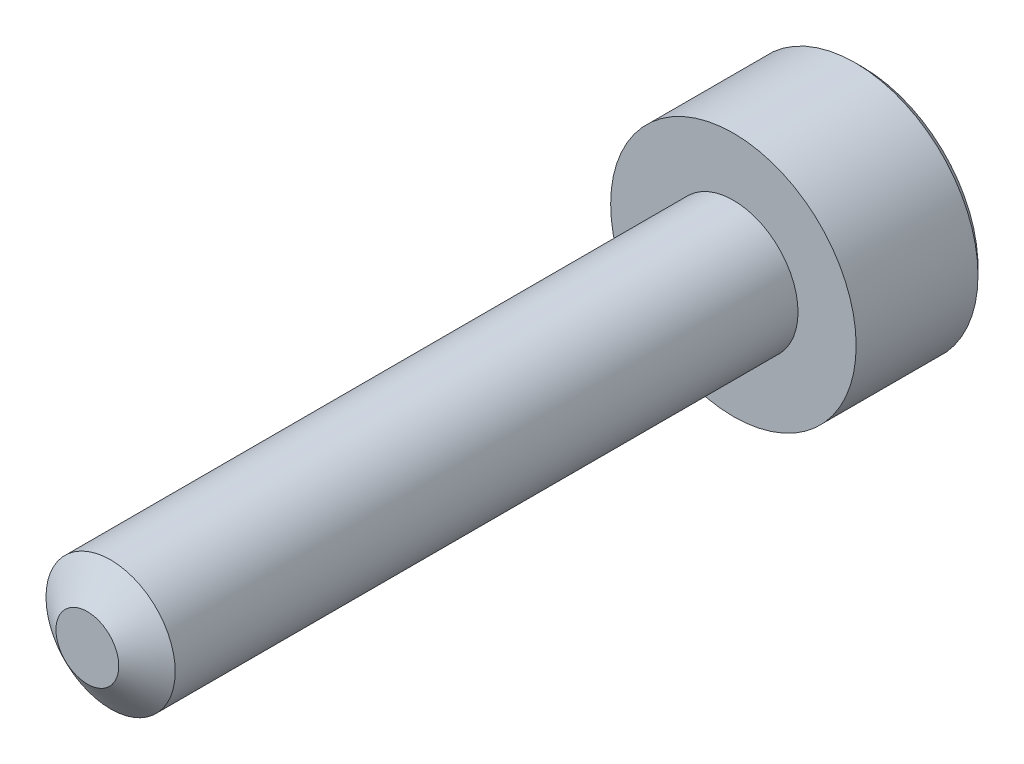
ISO-10303-21;
HEADER;
FILE_DESCRIPTION(('STEP AP214'),'2;1');
FILE_NAME('part.step','',(''),(''),'','','');
FILE_SCHEMA(('AUTOMOTIVE_DESIGN { 1 0 10303 214 1 1 1 1 }'));
ENDSEC;
DATA;
#1=APPLICATION_CONTEXT('core data for automotive mechanical design processes');
#2=APPLICATION_PROTOCOL_DEFINITION('international standard','automotive_design',2000,#1);
#3=PRODUCT_CONTEXT('',#1,'mechanical');
#4=PRODUCT('Part','Part','',(#3));
#5=PRODUCT_RELATED_PRODUCT_CATEGORY('part','',(#4));
#6=PRODUCT_DEFINITION_FORMATION('','',#4);
#7=PRODUCT_DEFINITION_CONTEXT('part definition',#1,'design');
#8=PRODUCT_DEFINITION('design','',#6,#7);
#9=PRODUCT_DEFINITION_SHAPE('','',#8);
#10=(LENGTH_UNIT() NAMED_UNIT(*) SI_UNIT(.MILLI.,.METRE.));
#11=(NAMED_UNIT(*) PLANE_ANGLE_UNIT() SI_UNIT($,.RADIAN.));
#12=(NAMED_UNIT(*) SI_UNIT($,.STERADIAN.) SOLID_ANGLE_UNIT());
#13=UNCERTAINTY_MEASURE_WITH_UNIT(LENGTH_MEASURE(1.E-05),#10,'distance_accuracy_value','');
#14=(GEOMETRIC_REPRESENTATION_CONTEXT(3) GLOBAL_UNCERTAINTY_ASSIGNED_CONTEXT((#13)) GLOBAL_UNIT_ASSIGNED_CONTEXT((#10,
#11,#12)) REPRESENTATION_CONTEXT('',''));
#15=CARTESIAN_POINT('',(0.,0.,0.));
#16=DIRECTION('',(0.,0.,1.));
#17=DIRECTION('',(1.,0.,0.));
#18=AXIS2_PLACEMENT_3D('',#15,#16,#17);
#19=CARTESIAN_POINT('',(0.75,1.29903810567666,-10.875));
#20=DIRECTION('',(0.,0.,-1.));
#21=DIRECTION('',(-1.,0.,0.));
#22=AXIS2_PLACEMENT_3D('',#19,#20,#21);
#23=PLANE('',#22);
#24=DIRECTION('',(0.866025403784439,-0.5,0.));
#25=VECTOR('',#24,1.);
#26=CARTESIAN_POINT('',(0.,-0.866025403784439,-10.875));
#27=LINE('',#26,#25);
#28=CARTESIAN_POINT('',(0.,-0.866025403784438,-10.875));
#29=VERTEX_POINT('',#28);
#30=CARTESIAN_POINT('',(-0.75,-0.43301270189222,-10.875));
#31=VERTEX_POINT('',#30);
#32=EDGE_CURVE('E83',#29,#31,#27,.F.);
#33=ORIENTED_EDGE('',*,*,#32,.T.);
#34=DIRECTION('',(0.,-1.,0.));
#35=VECTOR('',#34,1.);
#36=CARTESIAN_POINT('',(-0.75,-0.433012701892219,-10.875));
#37=LINE('',#36,#35);
#38=CARTESIAN_POINT('',(-0.75,0.43301270189222,-10.875));
#39=VERTEX_POINT('',#38);
#40=EDGE_CURVE('E85',#31,#39,#37,.F.);
#41=ORIENTED_EDGE('',*,*,#40,.T.);
#42=DIRECTION('',(-0.866025403784439,-0.5,0.));
#43=VECTOR('',#42,1.);
#44=CARTESIAN_POINT('',(-0.75,0.43301270189222,-10.875));
#45=LINE('',#44,#43);
#46=CARTESIAN_POINT('',(0.,0.866025403784439,-10.875));
#47=VERTEX_POINT('',#46);
#48=EDGE_CURVE('E86',#39,#47,#45,.F.);
#49=ORIENTED_EDGE('',*,*,#48,.T.);
#50=DIRECTION('',(-0.866025403784439,0.5,0.));
#51=VECTOR('',#50,1.);
#52=CARTESIAN_POINT('',(0.,0.866025403784439,-10.875));
#53=LINE('',#52,#51);
#54=CARTESIAN_POINT('',(0.75,0.43301270189222,-10.875));
#55=VERTEX_POINT('',#54);
#56=EDGE_CURVE('E72',#47,#55,#53,.F.);
#57=ORIENTED_EDGE('',*,*,#56,.T.);
#58=DIRECTION('',(0.,1.,0.));
#59=VECTOR('',#58,1.);
#60=CARTESIAN_POINT('',(0.75,0.433012701892219,-10.875));
#61=LINE('',#60,#59);
#62=CARTESIAN_POINT('',(0.75,-0.433012701892219,-10.875));
#63=VERTEX_POINT('',#62);
#64=EDGE_CURVE('E111',#55,#63,#61,.F.);
#65=ORIENTED_EDGE('',*,*,#64,.T.);
#66=DIRECTION('',(0.866025403784439,0.5,0.));
#67=VECTOR('',#66,1.);
#68=CARTESIAN_POINT('',(0.75,-0.433012701892219,-10.875));
#69=LINE('',#68,#67);
#70=EDGE_CURVE('E116',#63,#29,#69,.F.);
#71=ORIENTED_EDGE('',*,*,#70,.T.);
#72=EDGE_LOOP('',(#33,#41,#49,#57,#65,#71));
#73=FACE_BOUND('',#72,.T.);
#74=ADVANCED_FACE('F17',(#73),#23,.T.);
#75=CARTESIAN_POINT('',(-0.75,0.43301270189222,-10.875));
#76=DIRECTION('',(-0.5,0.866025403784439,0.));
#77=DIRECTION('',(-0.866025403784439,-0.5,0.));
#78=AXIS2_PLACEMENT_3D('',#75,#76,#77);
#79=PLANE('',#78);
#80=CARTESIAN_POINT('',(-0.750000000040529,0.43301270186855,-11.9999999999426));
#81=CARTESIAN_POINT('',(-0.724222098361885,0.447895580342032,-11.9851314747047));
#82=CARTESIAN_POINT('',(-0.698013243251965,0.463027269894967,-11.9711362751578));
#83=CARTESIAN_POINT('',(-0.644570697690296,0.493882337961228,-11.9455116575959));
#84=CARTESIAN_POINT('',(-0.617331927624619,0.509608649191022,-11.9338964924212));
#85=CARTESIAN_POINT('',(-0.562406176657021,0.541320046297593,-11.9139997801948));
#86=CARTESIAN_POINT('',(-0.534733177823342,0.557297059623507,-11.9056682343593));
#87=CARTESIAN_POINT('',(-0.478778549519084,0.589602479337379,-11.8928313651219));
#88=CARTESIAN_POINT('',(-0.450498627105905,0.605929900155289,-11.8883164648236));
#89=CARTESIAN_POINT('',(-0.401754212824382,0.634072500862216,-11.8842441635211));
#90=CARTESIAN_POINT('',(-0.381353021236444,0.645851134317301,-11.8836424251561));
#91=CARTESIAN_POINT('',(-0.340590218284616,0.669385549574463,-11.884656584782));
#92=CARTESIAN_POINT('',(-0.320228616658731,0.6811413257543,-11.8862729726425));
#93=CARTESIAN_POINT('',(-0.259434728846723,0.716240693247646,-11.8943424897742));
#94=CARTESIAN_POINT('',(-0.219305071732706,0.739409561584911,-11.9040168811747));
#95=CARTESIAN_POINT('',(-0.148902945251058,0.780056248260613,-11.9273532604901));
#96=CARTESIAN_POINT('',(-0.118299096510162,0.797725388569408,-11.9397877408232));
#97=CARTESIAN_POINT('',(-0.0582891007940733,0.83237217575016,-11.9677959637177));
#98=CARTESIAN_POINT('',(-0.028879420212564,0.849351862750675,-11.9833594872014));
#99=CARTESIAN_POINT('',(4.06728419388189E-11,0.866025403807922,-11.9999999999424));
#100=B_SPLINE_CURVE_WITH_KNOTS('',3,(#80,#81,#82,#83,#84,#85,#86,#87,#88,#89,#90,#91,#92,#93,
#94,#95,#96,#97,#98,#99),.UNSPECIFIED.,.F.,.F.,(4,2,2,2,2,2,2,2,2,4),(0.,0.0998872099789562,
0.200356156186847,0.299229995240019,0.39785499294776,0.46844734555236,0.539055290873642,
0.680311200793199,0.792547810185166,0.90442365474513),.UNSPECIFIED.);
#101=CARTESIAN_POINT('',(-0.750000000035288,0.433012701912593,-11.9999999999597));
#102=VERTEX_POINT('',#101);
#103=CARTESIAN_POINT('',(-5.02313178448405E-11,0.866025403836932,-11.9999999999715));
#104=VERTEX_POINT('',#103);
#105=EDGE_CURVE('E20',#102,#104,#100,.T.);
#106=ORIENTED_EDGE('',*,*,#105,.T.);
#107=DIRECTION('',(0.,0.,1.));
#108=VECTOR('',#107,1.);
#109=CARTESIAN_POINT('',(0.,0.866025403784439,-10.875));
#110=LINE('',#109,#108);
#111=EDGE_CURVE('E91',#104,#47,#110,.T.);
#112=ORIENTED_EDGE('',*,*,#111,.T.);
#113=ORIENTED_EDGE('',*,*,#48,.F.);
#114=DIRECTION('',(0.,0.,1.));
#115=VECTOR('',#114,1.);
#116=CARTESIAN_POINT('',(-0.75,0.43301270189222,-10.875));
#117=LINE('',#116,#115);
#118=EDGE_CURVE('E59',#39,#102,#117,.F.);
#119=ORIENTED_EDGE('',*,*,#118,.T.);
#120=EDGE_LOOP('',(#106,#112,#113,#119));
#121=FACE_BOUND('',#120,.T.);
#122=ADVANCED_FACE('F90',(#121),#79,.F.);
#123=CARTESIAN_POINT('',(-0.75,-0.433012701892219,-10.875));
#124=DIRECTION('',(-1.,0.,0.));
#125=DIRECTION('',(0.,-1.,0.));
#126=AXIS2_PLACEMENT_3D('',#123,#124,#125);
#127=PLANE('',#126);
#128=CARTESIAN_POINT('',(-0.749999999999766,-0.433012701939152,-11.9999999999426));
#129=CARTESIAN_POINT('',(-0.749999999999916,-0.403246944992447,-11.9851314747047));
#130=CARTESIAN_POINT('',(-0.749999999999977,-0.372983565886684,-11.9711362751578));
#131=CARTESIAN_POINT('',(-0.750000000000023,-0.31127342975424,-11.9455116575959));
#132=CARTESIAN_POINT('',(-0.750000000000006,-0.279820807294623,-11.9338964924212));
#133=CARTESIAN_POINT('',(-0.749999999999994,-0.21639801308146,-11.9139997801948));
#134=CARTESIAN_POINT('',(-0.749999999999998,-0.184443986429638,-11.9056682343593));
#135=CARTESIAN_POINT('',(-0.750000000000001,-0.119833147001899,-11.8928313651219));
#136=CARTESIAN_POINT('',(-0.75,-0.0871783053660778,-11.8883164648236));
#137=CARTESIAN_POINT('',(-0.75,-0.0308931039522219,-11.8842441635211));
#138=CARTESIAN_POINT('',(-0.75,-0.00733583704205067,-11.8836424251561));
#139=CARTESIAN_POINT('',(-0.75,0.0397329934722727,-11.884656584782));
#140=CARTESIAN_POINT('',(-0.75,0.0632445458319463,-11.8862729726425));
#141=CARTESIAN_POINT('',(-0.75,0.133443280818641,-11.8943424897742));
#142=CARTESIAN_POINT('',(-0.75,0.179781017493171,-11.9040168811747));
#143=CARTESIAN_POINT('',(-0.75,0.261074390844573,-11.9273532604901));
#144=CARTESIAN_POINT('',(-0.75,0.296412671462162,-11.9397877408232));
#145=CARTESIAN_POINT('',(-0.75,0.365706245823664,-11.9677959637177));
#146=CARTESIAN_POINT('',(-0.75,0.399665619824693,-11.9833594872014));
#147=CARTESIAN_POINT('',(-0.75,0.433012701939185,-11.9999999999424));
#148=B_SPLINE_CURVE_WITH_KNOTS('',3,(#128,#129,#130,#131,#132,#133,#134,#135,#136,#137,#138,
#139,#140,#141,#142,#143,#144,#145,#146,#147),.UNSPECIFIED.,.F.,.F.,(4,2,2,2,2,2,2,2,2,4),(0.,
0.0998872099789572,0.200356156186849,0.299229995240022,0.397854992947765,0.468447345552365,
0.539055290873648,0.680311200793207,0.79254781018517,0.904423654745129),.UNSPECIFIED.);
#149=CARTESIAN_POINT('',(-0.750000000035288,-0.433012701912593,-11.9999999999597));
#150=VERTEX_POINT('',#149);
#151=EDGE_CURVE('E95',#150,#102,#148,.T.);
#152=ORIENTED_EDGE('',*,*,#151,.T.);
#153=ORIENTED_EDGE('',*,*,#118,.F.);
#154=ORIENTED_EDGE('',*,*,#40,.F.);
#155=DIRECTION('',(0.,0.,1.));
#156=VECTOR('',#155,1.);
#157=CARTESIAN_POINT('',(-0.75,-0.43301270189222,-10.875));
#158=LINE('',#157,#156);
#159=EDGE_CURVE('E97',#31,#150,#158,.F.);
#160=ORIENTED_EDGE('',*,*,#159,.T.);
#161=EDGE_LOOP('',(#152,#153,#154,#160));
#162=FACE_BOUND('',#161,.T.);
#163=ADVANCED_FACE('F93',(#162),#127,.F.);
#164=CARTESIAN_POINT('',(0.,-0.866025403784439,-10.875));
#165=DIRECTION('',(-0.5,-0.866025403784439,0.));
#166=DIRECTION('',(0.866025403784439,-0.5,0.));
#167=AXIS2_PLACEMENT_3D('',#164,#165,#166);
#168=PLANE('',#167);
#169=CARTESIAN_POINT('',(4.07615997293175E-11,-0.866025403807703,-11.9999999999426));
#170=CARTESIAN_POINT('',(-0.0257779016380326,-0.85114252533448,-11.9851314747047));
#171=CARTESIAN_POINT('',(-0.0519867567480134,-0.836010835781652,-11.9711362751578));
#172=CARTESIAN_POINT('',(-0.105429302309728,-0.805155767715469,-11.945511657596));
#173=CARTESIAN_POINT('',(-0.132668072375389,-0.789429456485647,-11.9338964924212));
#174=CARTESIAN_POINT('',(-0.187593823342974,-0.757718059379055,-11.9139997801948));
#175=CARTESIAN_POINT('',(-0.215266822176659,-0.741741046053148,-11.9056682343593));
#176=CARTESIAN_POINT('',(-0.271221450480919,-0.709435626339281,-11.8928313651219));
#177=CARTESIAN_POINT('',(-0.299501372894097,-0.69310820552137,-11.8883164648236));
#178=CARTESIAN_POINT('',(-0.348245787175619,-0.664965604814442,-11.8842441635211));
#179=CARTESIAN_POINT('',(-0.368646978763558,-0.653186971359357,-11.8836424251561));
#180=CARTESIAN_POINT('',(-0.409409781715386,-0.629652556102195,-11.884656584782));
#181=CARTESIAN_POINT('',(-0.429771383341271,-0.617896779922359,-11.8862729726425));
#182=CARTESIAN_POINT('',(-0.490565271153279,-0.582797412429012,-11.8943424897742));
#183=CARTESIAN_POINT('',(-0.530694928267295,-0.559628544091747,-11.9040168811747));
#184=CARTESIAN_POINT('',(-0.601097054748943,-0.518981857416046,-11.9273532604901));
#185=CARTESIAN_POINT('',(-0.63170090348984,-0.50131271710725,-11.9397877408232));
#186=CARTESIAN_POINT('',(-0.691710899205928,-0.466665929926499,-11.9677959637177));
#187=CARTESIAN_POINT('',(-0.721120579787437,-0.449686242925983,-11.9833594872014));
#188=CARTESIAN_POINT('',(-0.750000000040674,-0.433012701868737,-11.9999999999424));
#189=B_SPLINE_CURVE_WITH_KNOTS('',3,(#169,#170,#171,#172,#173,#174,#175,#176,#177,#178,#179,
#180,#181,#182,#183,#184,#185,#186,#187,#188),.UNSPECIFIED.,.F.,.F.,(4,2,2,2,2,2,2,2,2,4),(0.,
0.0998872099789563,0.200356156186849,0.29922999524002,0.397854992947762,0.468447345552361,
0.539055290873643,0.6803112007932,0.792547810185166,0.904423654745131),.UNSPECIFIED.);
#190=CARTESIAN_POINT('',(0.,-0.866025403825186,-11.9999999999597));
#191=VERTEX_POINT('',#190);
#192=EDGE_CURVE('E198',#191,#150,#189,.T.);
#193=ORIENTED_EDGE('',*,*,#192,.T.);
#194=ORIENTED_EDGE('',*,*,#159,.F.);
#195=ORIENTED_EDGE('',*,*,#32,.F.);
#196=DIRECTION('',(0.,0.,1.));
#197=VECTOR('',#196,1.);
#198=CARTESIAN_POINT('',(0.,-0.866025403784438,-10.875));
#199=LINE('',#198,#197);
#200=EDGE_CURVE('E113',#29,#191,#199,.F.);
#201=ORIENTED_EDGE('',*,*,#200,.T.);
#202=EDGE_LOOP('',(#193,#194,#195,#201));
#203=FACE_BOUND('',#202,.T.);
#204=ADVANCED_FACE('F208',(#203),#168,.F.);
#205=CARTESIAN_POINT('',(0.75,-0.433012701892219,-10.875));
#206=DIRECTION('',(0.5,-0.866025403784439,0.));
#207=DIRECTION('',(0.866025403784439,0.5,0.));
#208=AXIS2_PLACEMENT_3D('',#205,#206,#207);
#209=PLANE('',#208);
#210=CARTESIAN_POINT('',(0.750000000040528,-0.43301270186855,-11.9999999999426));
#211=CARTESIAN_POINT('',(0.724222098361884,-0.447895580342032,-11.9851314747047));
#212=CARTESIAN_POINT('',(0.698013243251965,-0.463027269894967,-11.9711362751578));
#213=CARTESIAN_POINT('',(0.644570697690296,-0.493882337961228,-11.9455116575959));
#214=CARTESIAN_POINT('',(0.617331927624618,-0.509608649191022,-11.9338964924212));
#215=CARTESIAN_POINT('',(0.562406176657021,-0.541320046297592,-11.9139997801948));
#216=CARTESIAN_POINT('',(0.534733177823341,-0.557297059623507,-11.9056682343593));
#217=CARTESIAN_POINT('',(0.478778549519083,-0.589602479337379,-11.8928313651219));
#218=CARTESIAN_POINT('',(0.450498627105903,-0.605929900155289,-11.8883164648236));
#219=CARTESIAN_POINT('',(0.40175421282438,-0.634072500862216,-11.8842441635211));
#220=CARTESIAN_POINT('',(0.381353021236442,-0.645851134317301,-11.8836424251561));
#221=CARTESIAN_POINT('',(0.340590218284614,-0.669385549574463,-11.884656584782));
#222=CARTESIAN_POINT('',(0.320228616658729,-0.6811413257543,-11.8862729726425));
#223=CARTESIAN_POINT('',(0.259434728846721,-0.716240693247646,-11.8943424897742));
#224=CARTESIAN_POINT('',(0.219305071732705,-0.739409561584911,-11.9040168811747));
#225=CARTESIAN_POINT('',(0.148902945251057,-0.780056248260612,-11.9273532604901));
#226=CARTESIAN_POINT('',(0.118299096510161,-0.797725388569407,-11.9397877408232));
#227=CARTESIAN_POINT('',(0.0582891007940729,-0.832372175750159,-11.9677959637177));
#228=CARTESIAN_POINT('',(0.0288794202125636,-0.849351862750674,-11.9833594872014));
#229=CARTESIAN_POINT('',(-4.06730801948678E-11,-0.866025403807921,-11.9999999999424));
#230=B_SPLINE_CURVE_WITH_KNOTS('',3,(#210,#211,#212,#213,#214,#215,#216,#217,#218,#219,#220,
#221,#222,#223,#224,#225,#226,#227,#228,#229),.UNSPECIFIED.,.F.,.F.,(4,2,2,2,2,2,2,2,2,4),(0.,
0.0998872099789561,0.200356156186847,0.29922999524002,0.397854992947762,0.468447345552361,
0.539055290873644,0.6803112007932,0.792547810185166,0.90442365474513),.UNSPECIFIED.);
#231=CARTESIAN_POINT('',(0.750000000035288,-0.433012701912593,-11.9999999999597));
#232=VERTEX_POINT('',#231);
#233=EDGE_CURVE('E190',#232,#191,#230,.T.);
#234=ORIENTED_EDGE('',*,*,#233,.T.);
#235=ORIENTED_EDGE('',*,*,#200,.F.);
#236=ORIENTED_EDGE('',*,*,#70,.F.);
#237=DIRECTION('',(0.,0.,-1.));
#238=VECTOR('',#237,1.);
#239=CARTESIAN_POINT('',(0.75,-0.433012701892219,-10.875));
#240=LINE('',#239,#238);
#241=EDGE_CURVE('E108',#63,#232,#240,.T.);
#242=ORIENTED_EDGE('',*,*,#241,.T.);
#243=EDGE_LOOP('',(#234,#235,#236,#242));
#244=FACE_BOUND('',#243,.T.);
#245=ADVANCED_FACE('F204',(#244),#209,.F.);
#246=CARTESIAN_POINT('',(0.75,0.433012701892219,-10.875));
#247=DIRECTION('',(1.,0.,0.));
#248=DIRECTION('',(0.,0.,-1.));
#249=AXIS2_PLACEMENT_3D('',#246,#247,#248);
#250=PLANE('',#249);
#251=CARTESIAN_POINT('',(0.749999999999766,0.433012701939153,-11.9999999999426));
#252=CARTESIAN_POINT('',(0.749999999999916,0.403246944992448,-11.9851314747047));
#253=CARTESIAN_POINT('',(0.749999999999977,0.372983565886685,-11.9711362751578));
#254=CARTESIAN_POINT('',(0.750000000000023,0.311273429754241,-11.945511657596));
#255=CARTESIAN_POINT('',(0.750000000000006,0.279820807294624,-11.9338964924212));
#256=CARTESIAN_POINT('',(0.749999999999994,0.216398013081461,-11.9139997801948));
#257=CARTESIAN_POINT('',(0.749999999999998,0.184443986429639,-11.9056682343593));
#258=CARTESIAN_POINT('',(0.750000000000002,0.1198331470019,-11.8928313651219));
#259=CARTESIAN_POINT('',(0.75,0.0871783053660792,-11.8883164648236));
#260=CARTESIAN_POINT('',(0.75,0.0308931039522236,-11.8842441635211));
#261=CARTESIAN_POINT('',(0.75,0.00733583704205245,-11.8836424251561));
#262=CARTESIAN_POINT('',(0.75,-0.0397329934722707,-11.884656584782));
#263=CARTESIAN_POINT('',(0.75,-0.0632445458319443,-11.8862729726425));
#264=CARTESIAN_POINT('',(0.75,-0.133443280818639,-11.8943424897742));
#265=CARTESIAN_POINT('',(0.75,-0.179781017493169,-11.9040168811747));
#266=CARTESIAN_POINT('',(0.75,-0.261074390844572,-11.9273532604901));
#267=CARTESIAN_POINT('',(0.75,-0.296412671462161,-11.9397877408232));
#268=CARTESIAN_POINT('',(0.75,-0.365706245823663,-11.9677959637177));
#269=CARTESIAN_POINT('',(0.75,-0.399665619824692,-11.9833594872014));
#270=CARTESIAN_POINT('',(0.75,-0.433012701939185,-11.9999999999424));
#271=B_SPLINE_CURVE_WITH_KNOTS('',3,(#251,#252,#253,#254,#255,#256,#257,#258,#259,#260,#261,
#262,#263,#264,#265,#266,#267,#268,#269,#270),.UNSPECIFIED.,.F.,.F.,(4,2,2,2,2,2,2,2,2,4),(0.,
0.0998872099789555,0.200356156186849,0.299229995240022,0.397854992947764,0.468447345552364,
0.539055290873647,0.680311200793205,0.79254781018517,0.90442365474513),.UNSPECIFIED.);
#272=CARTESIAN_POINT('',(0.750000000035288,0.433012701912593,-11.9999999999597));
#273=VERTEX_POINT('',#272);
#274=EDGE_CURVE('E160',#273,#232,#271,.T.);
#275=ORIENTED_EDGE('',*,*,#274,.T.);
#276=ORIENTED_EDGE('',*,*,#241,.F.);
#277=ORIENTED_EDGE('',*,*,#64,.F.);
#278=DIRECTION('',(0.,0.,1.));
#279=VECTOR('',#278,1.);
#280=CARTESIAN_POINT('',(0.75,0.43301270189222,-10.875));
#281=LINE('',#280,#279);
#282=EDGE_CURVE('E40',#55,#273,#281,.F.);
#283=ORIENTED_EDGE('',*,*,#282,.T.);
#284=EDGE_LOOP('',(#275,#276,#277,#283));
#285=FACE_BOUND('',#284,.T.);
#286=ADVANCED_FACE('F207',(#285),#250,.F.);
#287=CARTESIAN_POINT('',(0.,0.866025403784439,-10.875));
#288=DIRECTION('',(0.5,0.866025403784439,0.));
#289=DIRECTION('',(-0.866025403784439,0.5,0.));
#290=AXIS2_PLACEMENT_3D('',#287,#288,#289);
#291=PLANE('',#290);
#292=CARTESIAN_POINT('',(-4.07615366949259E-11,0.866025403807703,-11.9999999999426));
#293=CARTESIAN_POINT('',(0.025777901638032,0.851142525334481,-11.9851314747047));
#294=CARTESIAN_POINT('',(0.0519867567480126,0.836010835781652,-11.9711362751578));
#295=CARTESIAN_POINT('',(0.105429302309727,0.80515576771547,-11.9455116575959));
#296=CARTESIAN_POINT('',(0.132668072375388,0.789429456485647,-11.9338964924212));
#297=CARTESIAN_POINT('',(0.187593823342974,0.757718059379055,-11.9139997801948));
#298=CARTESIAN_POINT('',(0.215266822176659,0.741741046053148,-11.9056682343593));
#299=CARTESIAN_POINT('',(0.271221450480919,0.709435626339282,-11.8928313651219));
#300=CARTESIAN_POINT('',(0.299501372894097,0.69310820552137,-11.8883164648236));
#301=CARTESIAN_POINT('',(0.348245787175619,0.664965604814442,-11.8842441635211));
#302=CARTESIAN_POINT('',(0.368646978763557,0.653186971359357,-11.8836424251561));
#303=CARTESIAN_POINT('',(0.409409781715385,0.629652556102196,-11.884656584782));
#304=CARTESIAN_POINT('',(0.42977138334127,0.617896779922359,-11.8862729726425));
#305=CARTESIAN_POINT('',(0.490565271153278,0.582797412429012,-11.8943424897742));
#306=CARTESIAN_POINT('',(0.530694928267295,0.559628544091747,-11.9040168811747));
#307=CARTESIAN_POINT('',(0.601097054748943,0.518981857416046,-11.9273532604901));
#308=CARTESIAN_POINT('',(0.631700903489839,0.501312717107251,-11.9397877408232));
#309=CARTESIAN_POINT('',(0.691710899205927,0.466665929926499,-11.9677959637177));
#310=CARTESIAN_POINT('',(0.721120579787436,0.449686242925984,-11.9833594872014));
#311=CARTESIAN_POINT('',(0.750000000040673,0.433012701868737,-11.9999999999424));
#312=B_SPLINE_CURVE_WITH_KNOTS('',3,(#292,#293,#294,#295,#296,#297,#298,#299,#300,#301,#302,
#303,#304,#305,#306,#307,#308,#309,#310,#311),.UNSPECIFIED.,.F.,.F.,(4,2,2,2,2,2,2,2,2,4),(0.,
0.0998872099789548,0.200356156186847,0.299229995240019,0.397854992947761,0.46844734555236,
0.539055290873642,0.680311200793199,0.792547810185166,0.904423654745129),.UNSPECIFIED.);
#313=EDGE_CURVE('E152',#104,#273,#312,.T.);
#314=ORIENTED_EDGE('',*,*,#313,.T.);
#315=ORIENTED_EDGE('',*,*,#282,.F.);
#316=ORIENTED_EDGE('',*,*,#56,.F.);
#317=ORIENTED_EDGE('',*,*,#111,.F.);
#318=EDGE_LOOP('',(#314,#315,#316,#317));
#319=FACE_BOUND('',#318,.T.);
#320=ADVANCED_FACE('F168',(#319),#291,.F.);
#321=CARTESIAN_POINT('',(0.,0.,-12.0000000000005));
#322=DIRECTION('',(0.,0.,-1.));
#323=DIRECTION('',(0.,1.,0.));
#324=AXIS2_PLACEMENT_3D('',#321,#322,#323);
#325=CONICAL_SURFACE('',#324,0.866025403865933,0.785398163640943);
#326=ORIENTED_EDGE('',*,*,#105,.F.);
#327=CARTESIAN_POINT('',(0.,0.,-12.0000000000005));
#328=DIRECTION('',(0.,0.,-1.));
#329=DIRECTION('',(0.,1.,0.));
#330=AXIS2_PLACEMENT_3D('',#327,#328,#329);
#331=CIRCLE('',#330,0.866025403865933);
#332=EDGE_CURVE('E149',#104,#102,#331,.F.);
#333=ORIENTED_EDGE('',*,*,#332,.F.);
#334=EDGE_LOOP('',(#326,#333));
#335=FACE_BOUND('',#334,.T.);
#336=ADVANCED_FACE('F225',(#335),#325,.F.);
#337=CARTESIAN_POINT('',(0.,0.,-12.0000000000005));
#338=DIRECTION('',(0.,0.,-1.));
#339=DIRECTION('',(0.,1.,0.));
#340=AXIS2_PLACEMENT_3D('',#337,#338,#339);
#341=CONICAL_SURFACE('',#340,0.866025403865933,0.785398163640948);
#342=CARTESIAN_POINT('',(0.,0.,-12.0000000000005));
#343=DIRECTION('',(0.,0.,-1.));
#344=DIRECTION('',(0.,1.,0.));
#345=AXIS2_PLACEMENT_3D('',#342,#343,#344);
#346=CIRCLE('',#345,0.866025403865933);
#347=EDGE_CURVE('E146',#102,#150,#346,.F.);
#348=ORIENTED_EDGE('',*,*,#347,.F.);
#349=ORIENTED_EDGE('',*,*,#151,.F.);
#350=EDGE_LOOP('',(#348,#349));
#351=FACE_BOUND('',#350,.T.);
#352=ADVANCED_FACE('F222',(#351),#341,.F.);
#353=CARTESIAN_POINT('',(0.,0.,-12.0000000000005));
#354=DIRECTION('',(0.,0.,-1.));
#355=DIRECTION('',(0.,1.,0.));
#356=AXIS2_PLACEMENT_3D('',#353,#354,#355);
#357=CONICAL_SURFACE('',#356,0.866025403865933,0.785398163640943);
#358=ORIENTED_EDGE('',*,*,#192,.F.);
#359=CARTESIAN_POINT('',(0.,0.,-12.0000000000005));
#360=DIRECTION('',(0.,0.,-1.));
#361=DIRECTION('',(0.,1.,0.));
#362=AXIS2_PLACEMENT_3D('',#359,#360,#361);
#363=CIRCLE('',#362,0.866025403865933);
#364=EDGE_CURVE('E143',#150,#191,#363,.F.);
#365=ORIENTED_EDGE('',*,*,#364,.F.);
#366=EDGE_LOOP('',(#358,#365));
#367=FACE_BOUND('',#366,.T.);
#368=ADVANCED_FACE('F186',(#367),#357,.F.);
#369=CARTESIAN_POINT('',(0.,0.,-12.0000000000005));
#370=DIRECTION('',(0.,0.,-1.));
#371=DIRECTION('',(0.,1.,0.));
#372=AXIS2_PLACEMENT_3D('',#369,#370,#371);
#373=CONICAL_SURFACE('',#372,0.866025403865933,0.785398163640943);
#374=ORIENTED_EDGE('',*,*,#233,.F.);
#375=CARTESIAN_POINT('',(0.,0.,-12.0000000000005));
#376=DIRECTION('',(0.,0.,-1.));
#377=DIRECTION('',(0.,1.,0.));
#378=AXIS2_PLACEMENT_3D('',#375,#376,#377);
#379=CIRCLE('',#378,0.866025403865933);
#380=EDGE_CURVE('E140',#191,#232,#379,.F.);
#381=ORIENTED_EDGE('',*,*,#380,.F.);
#382=EDGE_LOOP('',(#374,#381));
#383=FACE_BOUND('',#382,.T.);
#384=ADVANCED_FACE('F181',(#383),#373,.F.);
#385=CARTESIAN_POINT('',(0.,0.,-12.0000000000005));
#386=DIRECTION('',(0.,0.,-1.));
#387=DIRECTION('',(0.,1.,0.));
#388=AXIS2_PLACEMENT_3D('',#385,#386,#387);
#389=CONICAL_SURFACE('',#388,0.866025403865933,0.785398163640948);
#390=ORIENTED_EDGE('',*,*,#274,.F.);
#391=CARTESIAN_POINT('',(0.,0.,-12.0000000000005));
#392=DIRECTION('',(0.,0.,-1.));
#393=DIRECTION('',(0.,1.,0.));
#394=AXIS2_PLACEMENT_3D('',#391,#392,#393);
#395=CIRCLE('',#394,0.866025403865933);
#396=EDGE_CURVE('E137',#232,#273,#395,.F.);
#397=ORIENTED_EDGE('',*,*,#396,.F.);
#398=EDGE_LOOP('',(#390,#397));
#399=FACE_BOUND('',#398,.T.);
#400=ADVANCED_FACE('F175',(#399),#389,.F.);
#401=CARTESIAN_POINT('',(0.,0.,-12.0000000000005));
#402=DIRECTION('',(0.,0.,-1.));
#403=DIRECTION('',(0.,1.,0.));
#404=AXIS2_PLACEMENT_3D('',#401,#402,#403);
#405=CONICAL_SURFACE('',#404,0.866025403865933,0.785398163640943);
#406=ORIENTED_EDGE('',*,*,#313,.F.);
#407=CARTESIAN_POINT('',(0.,0.,-12.0000000000005));
#408=DIRECTION('',(0.,0.,-1.));
#409=DIRECTION('',(0.,1.,0.));
#410=AXIS2_PLACEMENT_3D('',#407,#408,#409);
#411=CIRCLE('',#410,0.866025403865933);
#412=EDGE_CURVE('E134',#273,#104,#411,.F.);
#413=ORIENTED_EDGE('',*,*,#412,.F.);
#414=EDGE_LOOP('',(#406,#413));
#415=FACE_BOUND('',#414,.T.);
#416=ADVANCED_FACE('F170',(#415),#405,.F.);
#417=CARTESIAN_POINT('',(0.,0.,-12.));
#418=DIRECTION('',(0.,0.,-1.));
#419=DIRECTION('',(-1.,0.,0.));
#420=AXIS2_PLACEMENT_3D('',#417,#418,#419);
#421=PLANE('',#420);
#422=ORIENTED_EDGE('',*,*,#396,.T.);
#423=ORIENTED_EDGE('',*,*,#412,.T.);
#424=ORIENTED_EDGE('',*,*,#332,.T.);
#425=ORIENTED_EDGE('',*,*,#347,.T.);
#426=ORIENTED_EDGE('',*,*,#364,.T.);
#427=ORIENTED_EDGE('',*,*,#380,.T.);
#428=EDGE_LOOP('',(#422,#423,#424,#425,#426,#427));
#429=FACE_BOUND('',#428,.T.);
#430=CARTESIAN_POINT('',(0.,0.,-12.0000000000005));
#431=DIRECTION('',(0.,0.,1.));
#432=DIRECTION('',(0.,-1.,0.));
#433=AXIS2_PLACEMENT_3D('',#430,#431,#432);
#434=CIRCLE('',#433,1.78599999992457);
#435=CARTESIAN_POINT('',(0.,-1.78599999992457,-12.0000000000005));
#436=VERTEX_POINT('',#435);
#437=EDGE_CURVE('E131',#436,#436,#434,.T.);
#438=ORIENTED_EDGE('',*,*,#437,.F.);
#439=EDGE_LOOP('',(#438));
#440=FACE_BOUND('',#439,.T.);
#441=ADVANCED_FACE('F174',(#429,#440),#421,.T.);
#442=CARTESIAN_POINT('',(0.,0.,-11.8859999999472));
#443=DIRECTION('',(0.,0.,1.));
#444=DIRECTION('',(0.,-1.,0.));
#445=AXIS2_PLACEMENT_3D('',#442,#443,#444);
#446=CONICAL_SURFACE('',#445,1.89999999997781,0.785398163397448);
#447=ORIENTED_EDGE('',*,*,#437,.T.);
#448=EDGE_LOOP('',(#447));
#449=FACE_BOUND('',#448,.T.);
#450=CARTESIAN_POINT('',(0.,0.,-11.886));
#451=DIRECTION('',(0.,0.,1.));
#452=DIRECTION('',(1.,0.,0.));
#453=AXIS2_PLACEMENT_3D('',#450,#451,#452);
#454=CIRCLE('',#453,1.9);
#455=CARTESIAN_POINT('',(1.9,0.,-11.886));
#456=VERTEX_POINT('',#455);
#457=EDGE_CURVE('E130',#456,#456,#454,.T.);
#458=ORIENTED_EDGE('',*,*,#457,.F.);
#459=EDGE_LOOP('',(#458));
#460=FACE_BOUND('',#459,.T.);
#461=ADVANCED_FACE('F257',(#449,#460),#446,.T.);
#462=CARTESIAN_POINT('',(0.,0.,0.));
#463=DIRECTION('',(0.,0.,1.));
#464=DIRECTION('',(1.,0.,0.));
#465=AXIS2_PLACEMENT_3D('',#462,#463,#464);
#466=PLANE('',#465);
#467=CARTESIAN_POINT('',(0.,0.,-2.84806900285872E-11));
#468=DIRECTION('',(0.,0.,-1.));
#469=DIRECTION('',(-1.,0.,0.));
#470=AXIS2_PLACEMENT_3D('',#467,#468,#469);
#471=CIRCLE('',#470,0.486192378843953);
#472=CARTESIAN_POINT('',(-0.486192378843953,0.,-2.84806900285872E-11));
#473=VERTEX_POINT('',#472);
#474=EDGE_CURVE('E127',#473,#473,#471,.T.);
#475=ORIENTED_EDGE('',*,*,#474,.F.);
#476=EDGE_LOOP('',(#475));
#477=FACE_BOUND('',#476,.T.);
#478=ADVANCED_FACE('F254',(#477),#466,.T.);
#479=CARTESIAN_POINT('',(0.,0.,-12.));
#480=DIRECTION('',(0.,0.,1.));
#481=DIRECTION('',(1.,0.,0.));
#482=AXIS2_PLACEMENT_3D('',#479,#480,#481);
#483=CYLINDRICAL_SURFACE('',#482,1.9);
#484=ORIENTED_EDGE('',*,*,#457,.T.);
#485=EDGE_LOOP('',(#484));
#486=FACE_BOUND('',#485,.T.);
#487=CARTESIAN_POINT('',(0.,0.,-10.));
#488=DIRECTION('',(0.,0.,1.));
#489=DIRECTION('',(1.,0.,0.));
#490=AXIS2_PLACEMENT_3D('',#487,#488,#489);
#491=CIRCLE('',#490,1.9);
#492=CARTESIAN_POINT('',(1.9,0.,-10.));
#493=VERTEX_POINT('',#492);
#494=EDGE_CURVE('E124',#493,#493,#491,.F.);
#495=ORIENTED_EDGE('',*,*,#494,.T.);
#496=EDGE_LOOP('',(#495));
#497=FACE_BOUND('',#496,.T.);
#498=ADVANCED_FACE('F250',(#486,#497),#483,.T.);
#499=CARTESIAN_POINT('',(0.,0.,-0.359771969328904));
#500=DIRECTION('',(0.,0.,-1.));
#501=DIRECTION('',(-1.,0.,0.));
#502=AXIS2_PLACEMENT_3D('',#499,#500,#501);
#503=CONICAL_SURFACE('',#502,0.999999999635293,0.959931088554136);
#504=ORIENTED_EDGE('',*,*,#474,.T.);
#505=EDGE_LOOP('',(#504));
#506=FACE_BOUND('',#505,.T.);
#507=CARTESIAN_POINT('',(0.,0.,-0.359771969508557));
#508=DIRECTION('',(0.,0.,1.));
#509=DIRECTION('',(1.,0.,0.));
#510=AXIS2_PLACEMENT_3D('',#507,#508,#509);
#511=CIRCLE('',#510,1.);
#512=CARTESIAN_POINT('',(1.,0.,-0.359771969508557));
#513=VERTEX_POINT('',#512);
#514=EDGE_CURVE('E31',#513,#513,#511,.F.);
#515=ORIENTED_EDGE('',*,*,#514,.F.);
#516=EDGE_LOOP('',(#515));
#517=FACE_BOUND('',#516,.T.);
#518=ADVANCED_FACE('F243',(#506,#517),#503,.T.);
#519=CARTESIAN_POINT('',(0.,0.,-10.));
#520=DIRECTION('',(0.,0.,-1.));
#521=DIRECTION('',(-1.,0.,0.));
#522=AXIS2_PLACEMENT_3D('',#519,#520,#521);
#523=PLANE('',#522);
#524=CARTESIAN_POINT('',(0.,0.,-10.));
#525=DIRECTION('',(0.,0.,1.));
#526=DIRECTION('',(1.,0.,0.));
#527=AXIS2_PLACEMENT_3D('',#524,#525,#526);
#528=CIRCLE('',#527,1.);
#529=CARTESIAN_POINT('',(1.,0.,-10.));
#530=VERTEX_POINT('',#529);
#531=EDGE_CURVE('E11',#530,#530,#528,.T.);
#532=ORIENTED_EDGE('',*,*,#531,.F.);
#533=EDGE_LOOP('',(#532));
#534=FACE_BOUND('',#533,.T.);
#535=ORIENTED_EDGE('',*,*,#494,.F.);
#536=EDGE_LOOP('',(#535));
#537=FACE_BOUND('',#536,.T.);
#538=ADVANCED_FACE('F237',(#534,#537),#523,.F.);
#539=CARTESIAN_POINT('',(0.,0.,-10.));
#540=DIRECTION('',(0.,0.,1.));
#541=DIRECTION('',(1.,0.,0.));
#542=AXIS2_PLACEMENT_3D('',#539,#540,#541);
#543=CYLINDRICAL_SURFACE('',#542,1.);
#544=ORIENTED_EDGE('',*,*,#531,.T.);
#545=EDGE_LOOP('',(#544));
#546=FACE_BOUND('',#545,.T.);
#547=ORIENTED_EDGE('',*,*,#514,.T.);
#548=EDGE_LOOP('',(#547));
#549=FACE_BOUND('',#548,.T.);
#550=ADVANCED_FACE('F235',(#546,#549),#543,.T.);
#551=CLOSED_SHELL('',(#74,#122,#163,#204,#245,#286,#320,#336,#352,#368,#384,#400,#416,#441,#461,
#478,#498,#518,#538,#550));
#552=MANIFOLD_SOLID_BREP('B1',#551);
#553=ADVANCED_BREP_SHAPE_REPRESENTATION('',(#18,#552),#14);
#554=SHAPE_DEFINITION_REPRESENTATION(#9,#553);
ENDSEC;
END-ISO-10303-21;
